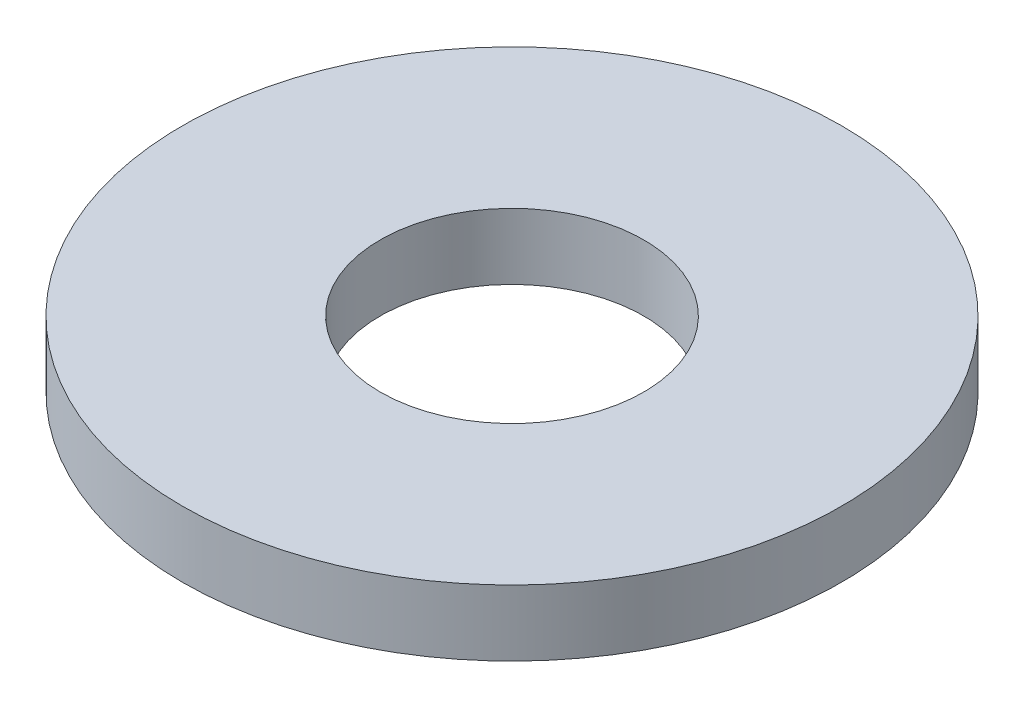
ISO-10303-21;
HEADER;
FILE_DESCRIPTION(('STEP AP214'),'2;1');
FILE_NAME('part.step','',(''),(''),'','','');
FILE_SCHEMA(('AUTOMOTIVE_DESIGN { 1 0 10303 214 1 1 1 1 }'));
ENDSEC;
DATA;
#1=APPLICATION_CONTEXT('core data for automotive mechanical design processes');
#2=APPLICATION_PROTOCOL_DEFINITION('international standard','automotive_design',2000,#1);
#3=PRODUCT_CONTEXT('',#1,'mechanical');
#4=PRODUCT('Part','Part','',(#3));
#5=PRODUCT_RELATED_PRODUCT_CATEGORY('part','',(#4));
#6=PRODUCT_DEFINITION_FORMATION('','',#4);
#7=PRODUCT_DEFINITION_CONTEXT('part definition',#1,'design');
#8=PRODUCT_DEFINITION('design','',#6,#7);
#9=PRODUCT_DEFINITION_SHAPE('','',#8);
#10=(LENGTH_UNIT() NAMED_UNIT(*) SI_UNIT(.MILLI.,.METRE.));
#11=(NAMED_UNIT(*) PLANE_ANGLE_UNIT() SI_UNIT($,.RADIAN.));
#12=(NAMED_UNIT(*) SI_UNIT($,.STERADIAN.) SOLID_ANGLE_UNIT());
#13=UNCERTAINTY_MEASURE_WITH_UNIT(LENGTH_MEASURE(1.E-05),#10,'distance_accuracy_value','');
#14=(GEOMETRIC_REPRESENTATION_CONTEXT(3) GLOBAL_UNCERTAINTY_ASSIGNED_CONTEXT((#13)) GLOBAL_UNIT_ASSIGNED_CONTEXT((#10,
#11,#12)) REPRESENTATION_CONTEXT('',''));
#15=CARTESIAN_POINT('',(0.,0.,0.));
#16=DIRECTION('',(0.,0.,1.));
#17=DIRECTION('',(1.,0.,0.));
#18=AXIS2_PLACEMENT_3D('',#15,#16,#17);
#19=CARTESIAN_POINT('',(0.,1.5875,0.));
#20=DIRECTION('',(0.,1.,0.));
#21=DIRECTION('',(0.,0.,1.));
#22=AXIS2_PLACEMENT_3D('',#19,#20,#21);
#23=PLANE('',#22);
#24=CARTESIAN_POINT('',(0.,1.5875,0.));
#25=DIRECTION('',(0.,1.,0.));
#26=DIRECTION('',(0.,0.,1.));
#27=AXIS2_PLACEMENT_3D('',#24,#25,#26);
#28=CIRCLE('',#27,7.9375);
#29=CARTESIAN_POINT('',(0.,1.5875,7.9375));
#30=VERTEX_POINT('',#29);
#31=EDGE_CURVE('E10',#30,#30,#28,.T.);
#32=ORIENTED_EDGE('',*,*,#31,.T.);
#33=EDGE_LOOP('',(#32));
#34=FACE_BOUND('',#33,.T.);
#35=CARTESIAN_POINT('',(0.,1.5875,0.));
#36=DIRECTION('',(0.,1.,0.));
#37=DIRECTION('',(0.,0.,1.));
#38=AXIS2_PLACEMENT_3D('',#35,#36,#37);
#39=CIRCLE('',#38,3.175);
#40=CARTESIAN_POINT('',(0.,1.5875,3.175));
#41=VERTEX_POINT('',#40);
#42=EDGE_CURVE('E44',#41,#41,#39,.T.);
#43=ORIENTED_EDGE('',*,*,#42,.F.);
#44=EDGE_LOOP('',(#43));
#45=FACE_BOUND('',#44,.T.);
#46=ADVANCED_FACE('F33',(#34,#45),#23,.T.);
#47=CARTESIAN_POINT('',(0.,0.,0.));
#48=DIRECTION('',(0.,1.,0.));
#49=DIRECTION('',(0.,0.,1.));
#50=AXIS2_PLACEMENT_3D('',#47,#48,#49);
#51=PLANE('',#50);
#52=CARTESIAN_POINT('',(0.,0.,0.));
#53=DIRECTION('',(0.,1.,0.));
#54=DIRECTION('',(0.,0.,1.));
#55=AXIS2_PLACEMENT_3D('',#52,#53,#54);
#56=CIRCLE('',#55,7.9375);
#57=CARTESIAN_POINT('',(0.,0.,7.9375));
#58=VERTEX_POINT('',#57);
#59=EDGE_CURVE('E37',#58,#58,#56,.T.);
#60=ORIENTED_EDGE('',*,*,#59,.F.);
#61=EDGE_LOOP('',(#60));
#62=FACE_BOUND('',#61,.T.);
#63=CARTESIAN_POINT('',(0.,0.,0.));
#64=DIRECTION('',(0.,1.,0.));
#65=DIRECTION('',(0.,0.,1.));
#66=AXIS2_PLACEMENT_3D('',#63,#64,#65);
#67=CIRCLE('',#66,3.175);
#68=CARTESIAN_POINT('',(0.,0.,3.175));
#69=VERTEX_POINT('',#68);
#70=EDGE_CURVE('E46',#69,#69,#67,.T.);
#71=ORIENTED_EDGE('',*,*,#70,.T.);
#72=EDGE_LOOP('',(#71));
#73=FACE_BOUND('',#72,.T.);
#74=ADVANCED_FACE('F56',(#62,#73),#51,.F.);
#75=CARTESIAN_POINT('',(0.,1.5875,0.));
#76=DIRECTION('',(0.,-1.,0.));
#77=DIRECTION('',(0.,0.,-1.));
#78=AXIS2_PLACEMENT_3D('',#75,#76,#77);
#79=CYLINDRICAL_SURFACE('',#78,7.9375);
#80=ORIENTED_EDGE('',*,*,#31,.F.);
#81=EDGE_LOOP('',(#80));
#82=FACE_BOUND('',#81,.T.);
#83=ORIENTED_EDGE('',*,*,#59,.T.);
#84=EDGE_LOOP('',(#83));
#85=FACE_BOUND('',#84,.T.);
#86=ADVANCED_FACE('F35',(#82,#85),#79,.T.);
#87=CARTESIAN_POINT('',(0.,1.5875,0.));
#88=DIRECTION('',(0.,-1.,0.));
#89=DIRECTION('',(0.,0.,-1.));
#90=AXIS2_PLACEMENT_3D('',#87,#88,#89);
#91=CYLINDRICAL_SURFACE('',#90,3.175);
#92=ORIENTED_EDGE('',*,*,#42,.T.);
#93=EDGE_LOOP('',(#92));
#94=FACE_BOUND('',#93,.T.);
#95=ORIENTED_EDGE('',*,*,#70,.F.);
#96=EDGE_LOOP('',(#95));
#97=FACE_BOUND('',#96,.T.);
#98=ADVANCED_FACE('F52',(#94,#97),#91,.F.);
#99=CLOSED_SHELL('',(#46,#74,#86,#98));
#100=MANIFOLD_SOLID_BREP('B2',#99);
#101=ADVANCED_BREP_SHAPE_REPRESENTATION('',(#18,#100),#14);
#102=SHAPE_DEFINITION_REPRESENTATION(#9,#101);
ENDSEC;
END-ISO-10303-21;
